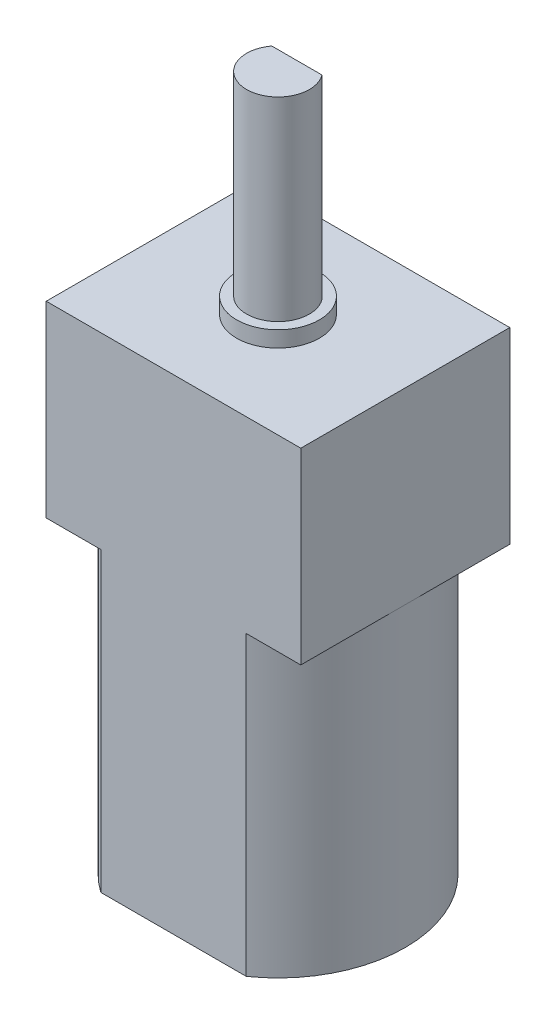
ISO-10303-21;
HEADER;
FILE_DESCRIPTION(('STEP AP214'),'2;1');
FILE_NAME('part.step','',(''),(''),'','','');
FILE_SCHEMA(('AUTOMOTIVE_DESIGN { 1 0 10303 214 1 1 1 1 }'));
ENDSEC;
DATA;
#1=APPLICATION_CONTEXT('core data for automotive mechanical design processes');
#2=APPLICATION_PROTOCOL_DEFINITION('international standard','automotive_design',2000,#1);
#3=PRODUCT_CONTEXT('',#1,'mechanical');
#4=PRODUCT('Part','Part','',(#3));
#5=PRODUCT_RELATED_PRODUCT_CATEGORY('part','',(#4));
#6=PRODUCT_DEFINITION_FORMATION('','',#4);
#7=PRODUCT_DEFINITION_CONTEXT('part definition',#1,'design');
#8=PRODUCT_DEFINITION('design','',#6,#7);
#9=PRODUCT_DEFINITION_SHAPE('','',#8);
#10=(LENGTH_UNIT() NAMED_UNIT(*) SI_UNIT(.MILLI.,.METRE.));
#11=(NAMED_UNIT(*) PLANE_ANGLE_UNIT() SI_UNIT($,.RADIAN.));
#12=(NAMED_UNIT(*) SI_UNIT($,.STERADIAN.) SOLID_ANGLE_UNIT());
#13=UNCERTAINTY_MEASURE_WITH_UNIT(LENGTH_MEASURE(1.E-05),#10,'distance_accuracy_value','');
#14=(GEOMETRIC_REPRESENTATION_CONTEXT(3) GLOBAL_UNCERTAINTY_ASSIGNED_CONTEXT((#13)) GLOBAL_UNIT_ASSIGNED_CONTEXT((#10,
#11,#12)) REPRESENTATION_CONTEXT('',''));
#15=CARTESIAN_POINT('',(0.,0.,0.));
#16=DIRECTION('',(0.,0.,1.));
#17=DIRECTION('',(1.,0.,0.));
#18=AXIS2_PLACEMENT_3D('',#15,#16,#17);
#19=CARTESIAN_POINT('',(0.,14.,0.));
#20=DIRECTION('',(0.,-1.,0.));
#21=DIRECTION('',(0.,0.,-1.));
#22=AXIS2_PLACEMENT_3D('',#19,#20,#21);
#23=CYLINDRICAL_SURFACE('',#22,6.00000000000001);
#24=CARTESIAN_POINT('',(0.,0.,0.));
#25=DIRECTION('',(0.,1.,0.));
#26=DIRECTION('',(0.,0.,1.));
#27=AXIS2_PLACEMENT_3D('',#24,#25,#26);
#28=CIRCLE('',#27,6.00000000000001);
#29=CARTESIAN_POINT('',(-3.42700671140285,0.,-4.925));
#30=VERTEX_POINT('',#29);
#31=CARTESIAN_POINT('',(-3.42700671140285,0.,4.925));
#32=VERTEX_POINT('',#31);
#33=EDGE_CURVE('E181',#30,#32,#28,.T.);
#34=ORIENTED_EDGE('',*,*,#33,.T.);
#35=DIRECTION('',(0.,-1.,0.));
#36=VECTOR('',#35,1.);
#37=CARTESIAN_POINT('',(-3.42700671140285,14.,4.925));
#38=LINE('',#37,#36);
#39=CARTESIAN_POINT('',(-3.42700671140285,14.,4.925));
#40=VERTEX_POINT('',#39);
#41=EDGE_CURVE('E37',#40,#32,#38,.T.);
#42=ORIENTED_EDGE('',*,*,#41,.F.);
#43=CARTESIAN_POINT('',(0.,14.,0.));
#44=DIRECTION('',(0.,1.,0.));
#45=DIRECTION('',(0.,0.,1.));
#46=AXIS2_PLACEMENT_3D('',#43,#44,#45);
#47=CIRCLE('',#46,6.00000000000001);
#48=CARTESIAN_POINT('',(-6.00000000000001,14.,0.));
#49=VERTEX_POINT('',#48);
#50=EDGE_CURVE('E185',#49,#40,#47,.T.);
#51=ORIENTED_EDGE('',*,*,#50,.F.);
#52=CARTESIAN_POINT('',(-3.42700671140285,14.,-4.925));
#53=VERTEX_POINT('',#52);
#54=EDGE_CURVE('E182',#53,#49,#47,.T.);
#55=ORIENTED_EDGE('',*,*,#54,.F.);
#56=DIRECTION('',(0.,-1.,0.));
#57=VECTOR('',#56,1.);
#58=CARTESIAN_POINT('',(-3.42700671140285,14.,-4.925));
#59=LINE('',#58,#57);
#60=EDGE_CURVE('E188',#53,#30,#59,.T.);
#61=ORIENTED_EDGE('',*,*,#60,.T.);
#62=EDGE_LOOP('',(#34,#42,#51,#55,#61));
#63=FACE_BOUND('',#62,.T.);
#64=ADVANCED_FACE('F34',(#63),#23,.T.);
#65=CARTESIAN_POINT('',(-3.42700671140285,14.,4.925));
#66=DIRECTION('',(0.,0.,-1.));
#67=DIRECTION('',(-1.,0.,0.));
#68=AXIS2_PLACEMENT_3D('',#65,#66,#67);
#69=PLANE('',#68);
#70=DIRECTION('',(1.,0.,0.));
#71=VECTOR('',#70,1.);
#72=CARTESIAN_POINT('',(-3.42700671140285,0.,4.925));
#73=LINE('',#72,#71);
#74=CARTESIAN_POINT('',(3.42700671140285,0.,4.925));
#75=VERTEX_POINT('',#74);
#76=EDGE_CURVE('E191',#32,#75,#73,.T.);
#77=ORIENTED_EDGE('',*,*,#76,.T.);
#78=DIRECTION('',(0.,-1.,0.));
#79=VECTOR('',#78,1.);
#80=CARTESIAN_POINT('',(3.42700671140285,14.,4.925));
#81=LINE('',#80,#79);
#82=CARTESIAN_POINT('',(3.42700671140285,14.,4.925));
#83=VERTEX_POINT('',#82);
#84=EDGE_CURVE('E201',#83,#75,#81,.T.);
#85=ORIENTED_EDGE('',*,*,#84,.F.);
#86=DIRECTION('',(1.,0.,0.));
#87=VECTOR('',#86,1.);
#88=CARTESIAN_POINT('',(6.00000000000001,14.,4.925));
#89=LINE('',#88,#87);
#90=CARTESIAN_POINT('',(6.00000000000001,14.,4.925));
#91=VERTEX_POINT('',#90);
#92=EDGE_CURVE('E167',#83,#91,#89,.T.);
#93=ORIENTED_EDGE('',*,*,#92,.T.);
#94=DIRECTION('',(0.,-1.,0.));
#95=VECTOR('',#94,1.);
#96=CARTESIAN_POINT('',(6.00000000000001,22.85,4.925));
#97=LINE('',#96,#95);
#98=CARTESIAN_POINT('',(6.00000000000001,22.85,4.925));
#99=VERTEX_POINT('',#98);
#100=EDGE_CURVE('E155',#99,#91,#97,.T.);
#101=ORIENTED_EDGE('',*,*,#100,.F.);
#102=DIRECTION('',(1.,0.,0.));
#103=VECTOR('',#102,1.);
#104=CARTESIAN_POINT('',(6.00000000000001,22.85,4.925));
#105=LINE('',#104,#103);
#106=CARTESIAN_POINT('',(-6.00000000000001,22.85,4.925));
#107=VERTEX_POINT('',#106);
#108=EDGE_CURVE('E153',#107,#99,#105,.T.);
#109=ORIENTED_EDGE('',*,*,#108,.F.);
#110=DIRECTION('',(0.,-1.,0.));
#111=VECTOR('',#110,1.);
#112=CARTESIAN_POINT('',(-6.00000000000001,22.85,4.925));
#113=LINE('',#112,#111);
#114=CARTESIAN_POINT('',(-6.00000000000001,14.,4.925));
#115=VERTEX_POINT('',#114);
#116=EDGE_CURVE('E172',#107,#115,#113,.T.);
#117=ORIENTED_EDGE('',*,*,#116,.T.);
#118=EDGE_CURVE('E149',#115,#40,#89,.T.);
#119=ORIENTED_EDGE('',*,*,#118,.T.);
#120=ORIENTED_EDGE('',*,*,#41,.T.);
#121=EDGE_LOOP('',(#77,#85,#93,#101,#109,#117,#119,#120));
#122=FACE_BOUND('',#121,.T.);
#123=ADVANCED_FACE('F206',(#122),#69,.F.);
#124=CARTESIAN_POINT('',(0.,14.,0.));
#125=DIRECTION('',(0.,-1.,0.));
#126=DIRECTION('',(0.,0.,-1.));
#127=AXIS2_PLACEMENT_3D('',#124,#125,#126);
#128=CYLINDRICAL_SURFACE('',#127,6.00000000000001);
#129=CARTESIAN_POINT('',(0.,0.,0.));
#130=DIRECTION('',(0.,1.,0.));
#131=DIRECTION('',(0.,0.,1.));
#132=AXIS2_PLACEMENT_3D('',#129,#130,#131);
#133=CIRCLE('',#132,6.00000000000001);
#134=CARTESIAN_POINT('',(3.42700671140285,0.,-4.925));
#135=VERTEX_POINT('',#134);
#136=EDGE_CURVE('E193',#75,#135,#133,.T.);
#137=ORIENTED_EDGE('',*,*,#136,.T.);
#138=DIRECTION('',(0.,-1.,0.));
#139=VECTOR('',#138,1.);
#140=CARTESIAN_POINT('',(3.42700671140285,14.,-4.925));
#141=LINE('',#140,#139);
#142=CARTESIAN_POINT('',(3.42700671140285,14.,-4.925));
#143=VERTEX_POINT('',#142);
#144=EDGE_CURVE('E199',#143,#135,#141,.T.);
#145=ORIENTED_EDGE('',*,*,#144,.F.);
#146=CARTESIAN_POINT('',(0.,14.,0.));
#147=DIRECTION('',(0.,1.,0.));
#148=DIRECTION('',(0.,0.,1.));
#149=AXIS2_PLACEMENT_3D('',#146,#147,#148);
#150=CIRCLE('',#149,6.00000000000001);
#151=CARTESIAN_POINT('',(6.00000000000001,14.,0.));
#152=VERTEX_POINT('',#151);
#153=EDGE_CURVE('E57',#152,#143,#150,.T.);
#154=ORIENTED_EDGE('',*,*,#153,.F.);
#155=EDGE_CURVE('E186',#83,#152,#150,.T.);
#156=ORIENTED_EDGE('',*,*,#155,.F.);
#157=ORIENTED_EDGE('',*,*,#84,.T.);
#158=EDGE_LOOP('',(#137,#145,#154,#156,#157));
#159=FACE_BOUND('',#158,.T.);
#160=ADVANCED_FACE('F215',(#159),#128,.T.);
#161=CARTESIAN_POINT('',(-3.42700671140285,14.,-4.925));
#162=DIRECTION('',(0.,0.,1.));
#163=DIRECTION('',(1.,0.,0.));
#164=AXIS2_PLACEMENT_3D('',#161,#162,#163);
#165=PLANE('',#164);
#166=DIRECTION('',(-1.,0.,0.));
#167=VECTOR('',#166,1.);
#168=CARTESIAN_POINT('',(-3.42700671140285,0.,-4.925));
#169=LINE('',#168,#167);
#170=EDGE_CURVE('E195',#135,#30,#169,.T.);
#171=ORIENTED_EDGE('',*,*,#170,.T.);
#172=ORIENTED_EDGE('',*,*,#60,.F.);
#173=DIRECTION('',(-1.,0.,0.));
#174=VECTOR('',#173,1.);
#175=CARTESIAN_POINT('',(6.00000000000001,14.,-4.925));
#176=LINE('',#175,#174);
#177=CARTESIAN_POINT('',(-6.00000000000001,14.,-4.925));
#178=VERTEX_POINT('',#177);
#179=EDGE_CURVE('E159',#53,#178,#176,.T.);
#180=ORIENTED_EDGE('',*,*,#179,.T.);
#181=DIRECTION('',(0.,-1.,0.));
#182=VECTOR('',#181,1.);
#183=CARTESIAN_POINT('',(-6.00000000000001,22.85,-4.925));
#184=LINE('',#183,#182);
#185=CARTESIAN_POINT('',(-6.00000000000001,22.85,-4.925));
#186=VERTEX_POINT('',#185);
#187=EDGE_CURVE('E175',#186,#178,#184,.T.);
#188=ORIENTED_EDGE('',*,*,#187,.F.);
#189=DIRECTION('',(-1.,0.,0.));
#190=VECTOR('',#189,1.);
#191=CARTESIAN_POINT('',(6.00000000000001,22.85,-4.925));
#192=LINE('',#191,#190);
#193=CARTESIAN_POINT('',(6.00000000000001,22.85,-4.925));
#194=VERTEX_POINT('',#193);
#195=EDGE_CURVE('E148',#194,#186,#192,.T.);
#196=ORIENTED_EDGE('',*,*,#195,.F.);
#197=DIRECTION('',(0.,-1.,0.));
#198=VECTOR('',#197,1.);
#199=CARTESIAN_POINT('',(6.00000000000001,22.85,-4.925));
#200=LINE('',#199,#198);
#201=CARTESIAN_POINT('',(6.00000000000001,14.,-4.925));
#202=VERTEX_POINT('',#201);
#203=EDGE_CURVE('E178',#194,#202,#200,.T.);
#204=ORIENTED_EDGE('',*,*,#203,.T.);
#205=EDGE_CURVE('E160',#202,#143,#176,.T.);
#206=ORIENTED_EDGE('',*,*,#205,.T.);
#207=ORIENTED_EDGE('',*,*,#144,.T.);
#208=EDGE_LOOP('',(#171,#172,#180,#188,#196,#204,#206,#207));
#209=FACE_BOUND('',#208,.T.);
#210=ADVANCED_FACE('F217',(#209),#165,.F.);
#211=CARTESIAN_POINT('',(0.,0.,0.));
#212=DIRECTION('',(0.,1.,0.));
#213=DIRECTION('',(0.,0.,1.));
#214=AXIS2_PLACEMENT_3D('',#211,#212,#213);
#215=PLANE('',#214);
#216=CARTESIAN_POINT('',(0.,0.,0.));
#217=DIRECTION('',(0.,-1.,0.));
#218=DIRECTION('',(0.,0.,-1.));
#219=AXIS2_PLACEMENT_3D('',#216,#217,#218);
#220=CIRCLE('',#219,2.47);
#221=CARTESIAN_POINT('',(0.,0.,-2.47));
#222=VERTEX_POINT('',#221);
#223=EDGE_CURVE('E11',#222,#222,#220,.T.);
#224=ORIENTED_EDGE('',*,*,#223,.F.);
#225=EDGE_LOOP('',(#224));
#226=FACE_BOUND('',#225,.T.);
#227=ORIENTED_EDGE('',*,*,#33,.F.);
#228=ORIENTED_EDGE('',*,*,#170,.F.);
#229=ORIENTED_EDGE('',*,*,#136,.F.);
#230=ORIENTED_EDGE('',*,*,#76,.F.);
#231=EDGE_LOOP('',(#227,#228,#229,#230));
#232=FACE_BOUND('',#231,.T.);
#233=ADVANCED_FACE('F214',(#226,#232),#215,.F.);
#234=CARTESIAN_POINT('',(0.,14.,0.));
#235=DIRECTION('',(0.,-1.,0.));
#236=DIRECTION('',(0.,0.,-1.));
#237=AXIS2_PLACEMENT_3D('',#234,#235,#236);
#238=PLANE('',#237);
#239=ORIENTED_EDGE('',*,*,#179,.F.);
#240=ORIENTED_EDGE('',*,*,#54,.T.);
#241=DIRECTION('',(0.,0.,1.));
#242=VECTOR('',#241,1.);
#243=CARTESIAN_POINT('',(-6.00000000000001,14.,-4.925));
#244=LINE('',#243,#242);
#245=EDGE_CURVE('E164',#178,#49,#244,.T.);
#246=ORIENTED_EDGE('',*,*,#245,.F.);
#247=EDGE_LOOP('',(#239,#240,#246));
#248=FACE_BOUND('',#247,.T.);
#249=ADVANCED_FACE('F245',(#248),#238,.T.);
#250=EDGE_CURVE('E163',#49,#115,#244,.T.);
#251=ORIENTED_EDGE('',*,*,#250,.F.);
#252=ORIENTED_EDGE('',*,*,#50,.T.);
#253=ORIENTED_EDGE('',*,*,#118,.F.);
#254=EDGE_LOOP('',(#251,#252,#253));
#255=FACE_BOUND('',#254,.T.);
#256=ADVANCED_FACE('F241',(#255),#238,.T.);
#257=ORIENTED_EDGE('',*,*,#92,.F.);
#258=ORIENTED_EDGE('',*,*,#155,.T.);
#259=DIRECTION('',(0.,0.,-1.));
#260=VECTOR('',#259,1.);
#261=CARTESIAN_POINT('',(6.00000000000001,14.,-4.925));
#262=LINE('',#261,#260);
#263=EDGE_CURVE('E156',#91,#152,#262,.T.);
#264=ORIENTED_EDGE('',*,*,#263,.F.);
#265=EDGE_LOOP('',(#257,#258,#264));
#266=FACE_BOUND('',#265,.T.);
#267=ADVANCED_FACE('F230',(#266),#238,.T.);
#268=CARTESIAN_POINT('',(6.00000000000001,22.85,-4.925));
#269=DIRECTION('',(-1.,0.,0.));
#270=DIRECTION('',(0.,0.,1.));
#271=AXIS2_PLACEMENT_3D('',#268,#269,#270);
#272=PLANE('',#271);
#273=ORIENTED_EDGE('',*,*,#263,.T.);
#274=EDGE_CURVE('E138',#152,#202,#262,.T.);
#275=ORIENTED_EDGE('',*,*,#274,.T.);
#276=ORIENTED_EDGE('',*,*,#203,.F.);
#277=DIRECTION('',(0.,0.,-1.));
#278=VECTOR('',#277,1.);
#279=CARTESIAN_POINT('',(6.00000000000001,22.85,-4.925));
#280=LINE('',#279,#278);
#281=EDGE_CURVE('E145',#99,#194,#280,.T.);
#282=ORIENTED_EDGE('',*,*,#281,.F.);
#283=ORIENTED_EDGE('',*,*,#100,.T.);
#284=EDGE_LOOP('',(#273,#275,#276,#282,#283));
#285=FACE_BOUND('',#284,.T.);
#286=ADVANCED_FACE('F225',(#285),#272,.F.);
#287=CARTESIAN_POINT('',(-6.00000000000001,22.85,-4.925));
#288=DIRECTION('',(1.,0.,0.));
#289=DIRECTION('',(0.,0.,-1.));
#290=AXIS2_PLACEMENT_3D('',#287,#288,#289);
#291=PLANE('',#290);
#292=ORIENTED_EDGE('',*,*,#245,.T.);
#293=ORIENTED_EDGE('',*,*,#250,.T.);
#294=ORIENTED_EDGE('',*,*,#116,.F.);
#295=DIRECTION('',(0.,0.,1.));
#296=VECTOR('',#295,1.);
#297=CARTESIAN_POINT('',(-6.00000000000001,22.85,-4.925));
#298=LINE('',#297,#296);
#299=EDGE_CURVE('E151',#186,#107,#298,.T.);
#300=ORIENTED_EDGE('',*,*,#299,.F.);
#301=ORIENTED_EDGE('',*,*,#187,.T.);
#302=EDGE_LOOP('',(#292,#293,#294,#300,#301));
#303=FACE_BOUND('',#302,.T.);
#304=ADVANCED_FACE('F238',(#303),#291,.F.);
#305=CARTESIAN_POINT('',(0.,22.85,0.));
#306=DIRECTION('',(0.,-1.,0.));
#307=DIRECTION('',(0.,0.,-1.));
#308=AXIS2_PLACEMENT_3D('',#305,#306,#307);
#309=PLANE('',#308);
#310=CARTESIAN_POINT('',(0.,22.85,0.));
#311=DIRECTION('',(0.,1.,0.));
#312=DIRECTION('',(0.,0.,1.));
#313=AXIS2_PLACEMENT_3D('',#310,#311,#312);
#314=CIRCLE('',#313,1.95);
#315=CARTESIAN_POINT('',(0.,22.85,1.95));
#316=VERTEX_POINT('',#315);
#317=EDGE_CURVE('E42',#316,#316,#314,.T.);
#318=ORIENTED_EDGE('',*,*,#317,.F.);
#319=EDGE_LOOP('',(#318));
#320=FACE_BOUND('',#319,.T.);
#321=ORIENTED_EDGE('',*,*,#281,.T.);
#322=ORIENTED_EDGE('',*,*,#195,.T.);
#323=ORIENTED_EDGE('',*,*,#299,.T.);
#324=ORIENTED_EDGE('',*,*,#108,.T.);
#325=EDGE_LOOP('',(#321,#322,#323,#324));
#326=FACE_BOUND('',#325,.T.);
#327=ADVANCED_FACE('F233',(#320,#326),#309,.F.);
#328=ORIENTED_EDGE('',*,*,#274,.F.);
#329=ORIENTED_EDGE('',*,*,#153,.T.);
#330=ORIENTED_EDGE('',*,*,#205,.F.);
#331=EDGE_LOOP('',(#328,#329,#330));
#332=FACE_BOUND('',#331,.T.);
#333=ADVANCED_FACE('F222',(#332),#238,.T.);
#334=CARTESIAN_POINT('',(0.,23.6,0.));
#335=DIRECTION('',(0.,-1.,0.));
#336=DIRECTION('',(0.,0.,-1.));
#337=AXIS2_PLACEMENT_3D('',#334,#335,#336);
#338=CYLINDRICAL_SURFACE('',#337,1.95);
#339=CARTESIAN_POINT('',(0.,23.6,0.));
#340=DIRECTION('',(0.,1.,0.));
#341=DIRECTION('',(0.,0.,1.));
#342=AXIS2_PLACEMENT_3D('',#339,#340,#341);
#343=CIRCLE('',#342,1.95);
#344=CARTESIAN_POINT('',(0.,23.6,1.95));
#345=VERTEX_POINT('',#344);
#346=EDGE_CURVE('E135',#345,#345,#343,.T.);
#347=ORIENTED_EDGE('',*,*,#346,.F.);
#348=EDGE_LOOP('',(#347));
#349=FACE_BOUND('',#348,.T.);
#350=ORIENTED_EDGE('',*,*,#317,.T.);
#351=EDGE_LOOP('',(#350));
#352=FACE_BOUND('',#351,.T.);
#353=ADVANCED_FACE('F257',(#349,#352),#338,.T.);
#354=CARTESIAN_POINT('',(0.,23.6,0.));
#355=DIRECTION('',(0.,1.,0.));
#356=DIRECTION('',(0.,0.,1.));
#357=AXIS2_PLACEMENT_3D('',#354,#355,#356);
#358=PLANE('',#357);
#359=CARTESIAN_POINT('',(0.,23.6,0.));
#360=DIRECTION('',(0.,1.,0.));
#361=DIRECTION('',(0.,0.,1.));
#362=AXIS2_PLACEMENT_3D('',#359,#360,#361);
#363=CIRCLE('',#362,1.48);
#364=CARTESIAN_POINT('',(-1.18249735729092,23.6,-0.89));
#365=VERTEX_POINT('',#364);
#366=CARTESIAN_POINT('',(1.18249735729092,23.6,-0.89));
#367=VERTEX_POINT('',#366);
#368=EDGE_CURVE('E134',#365,#367,#363,.T.);
#369=ORIENTED_EDGE('',*,*,#368,.F.);
#370=DIRECTION('',(-1.,0.,0.));
#371=VECTOR('',#370,1.);
#372=CARTESIAN_POINT('',(-1.18249735729092,23.6,-0.89));
#373=LINE('',#372,#371);
#374=EDGE_CURVE('E49',#367,#365,#373,.T.);
#375=ORIENTED_EDGE('',*,*,#374,.F.);
#376=EDGE_LOOP('',(#369,#375));
#377=FACE_BOUND('',#376,.T.);
#378=ORIENTED_EDGE('',*,*,#346,.T.);
#379=EDGE_LOOP('',(#378));
#380=FACE_BOUND('',#379,.T.);
#381=ADVANCED_FACE('F281',(#377,#380),#358,.T.);
#382=CARTESIAN_POINT('',(0.,32.77,0.));
#383=DIRECTION('',(0.,-1.,0.));
#384=DIRECTION('',(0.,0.,-1.));
#385=AXIS2_PLACEMENT_3D('',#382,#383,#384);
#386=CYLINDRICAL_SURFACE('',#385,1.48);
#387=ORIENTED_EDGE('',*,*,#368,.T.);
#388=DIRECTION('',(0.,-1.,0.));
#389=VECTOR('',#388,1.);
#390=CARTESIAN_POINT('',(1.18249735729092,32.77,-0.89));
#391=LINE('',#390,#389);
#392=CARTESIAN_POINT('',(1.18249735729092,32.77,-0.89));
#393=VERTEX_POINT('',#392);
#394=EDGE_CURVE('E122',#393,#367,#391,.T.);
#395=ORIENTED_EDGE('',*,*,#394,.F.);
#396=CARTESIAN_POINT('',(0.,32.77,0.));
#397=DIRECTION('',(0.,1.,0.));
#398=DIRECTION('',(0.,0.,1.));
#399=AXIS2_PLACEMENT_3D('',#396,#397,#398);
#400=CIRCLE('',#399,1.48);
#401=CARTESIAN_POINT('',(-1.18249735729092,32.77,-0.89));
#402=VERTEX_POINT('',#401);
#403=EDGE_CURVE('E128',#402,#393,#400,.T.);
#404=ORIENTED_EDGE('',*,*,#403,.F.);
#405=DIRECTION('',(0.,-1.,0.));
#406=VECTOR('',#405,1.);
#407=CARTESIAN_POINT('',(-1.18249735729092,32.77,-0.89));
#408=LINE('',#407,#406);
#409=EDGE_CURVE('E125',#402,#365,#408,.T.);
#410=ORIENTED_EDGE('',*,*,#409,.T.);
#411=EDGE_LOOP('',(#387,#395,#404,#410));
#412=FACE_BOUND('',#411,.T.);
#413=ADVANCED_FACE('F133',(#412),#386,.T.);
#414=CARTESIAN_POINT('',(-1.18249735729092,32.77,-0.89));
#415=DIRECTION('',(0.,0.,1.));
#416=DIRECTION('',(1.,0.,0.));
#417=AXIS2_PLACEMENT_3D('',#414,#415,#416);
#418=PLANE('',#417);
#419=ORIENTED_EDGE('',*,*,#374,.T.);
#420=ORIENTED_EDGE('',*,*,#409,.F.);
#421=DIRECTION('',(-1.,0.,0.));
#422=VECTOR('',#421,1.);
#423=CARTESIAN_POINT('',(-1.18249735729092,32.77,-0.89));
#424=LINE('',#423,#422);
#425=EDGE_CURVE('E118',#393,#402,#424,.T.);
#426=ORIENTED_EDGE('',*,*,#425,.F.);
#427=ORIENTED_EDGE('',*,*,#394,.T.);
#428=EDGE_LOOP('',(#419,#420,#426,#427));
#429=FACE_BOUND('',#428,.T.);
#430=ADVANCED_FACE('F120',(#429),#418,.F.);
#431=CARTESIAN_POINT('',(0.,32.77,0.));
#432=DIRECTION('',(0.,1.,0.));
#433=DIRECTION('',(0.,0.,1.));
#434=AXIS2_PLACEMENT_3D('',#431,#432,#433);
#435=PLANE('',#434);
#436=ORIENTED_EDGE('',*,*,#403,.T.);
#437=ORIENTED_EDGE('',*,*,#425,.T.);
#438=EDGE_LOOP('',(#436,#437));
#439=FACE_BOUND('',#438,.T.);
#440=ADVANCED_FACE('F130',(#439),#435,.T.);
#441=CARTESIAN_POINT('',(0.,-1.14,0.));
#442=DIRECTION('',(0.,1.,0.));
#443=DIRECTION('',(0.,0.,1.));
#444=AXIS2_PLACEMENT_3D('',#441,#442,#443);
#445=CYLINDRICAL_SURFACE('',#444,2.47);
#446=CARTESIAN_POINT('',(0.,-1.14,0.));
#447=DIRECTION('',(0.,-1.,0.));
#448=DIRECTION('',(0.,0.,-1.));
#449=AXIS2_PLACEMENT_3D('',#446,#447,#448);
#450=CIRCLE('',#449,2.47);
#451=CARTESIAN_POINT('',(0.,-1.14,-2.47));
#452=VERTEX_POINT('',#451);
#453=EDGE_CURVE('E302',#452,#452,#450,.T.);
#454=ORIENTED_EDGE('',*,*,#453,.F.);
#455=EDGE_LOOP('',(#454));
#456=FACE_BOUND('',#455,.T.);
#457=ORIENTED_EDGE('',*,*,#223,.T.);
#458=EDGE_LOOP('',(#457));
#459=FACE_BOUND('',#458,.T.);
#460=ADVANCED_FACE('F291',(#456,#459),#445,.T.);
#461=CARTESIAN_POINT('',(0.,-1.14,0.));
#462=DIRECTION('',(0.,-1.,0.));
#463=DIRECTION('',(0.,0.,-1.));
#464=AXIS2_PLACEMENT_3D('',#461,#462,#463);
#465=PLANE('',#464);
#466=ORIENTED_EDGE('',*,*,#453,.T.);
#467=EDGE_LOOP('',(#466));
#468=FACE_BOUND('',#467,.T.);
#469=ADVANCED_FACE('F294',(#468),#465,.T.);
#470=CLOSED_SHELL('',(#64,#123,#160,#210,#233,#249,#256,#267,#286,#304,#327,#333,#353,#381,#413,
#430,#440,#460,#469));
#471=MANIFOLD_SOLID_BREP('B2',#470);
#472=ADVANCED_BREP_SHAPE_REPRESENTATION('',(#18,#471),#14);
#473=SHAPE_DEFINITION_REPRESENTATION(#9,#472);
ENDSEC;
END-ISO-10303-21;
